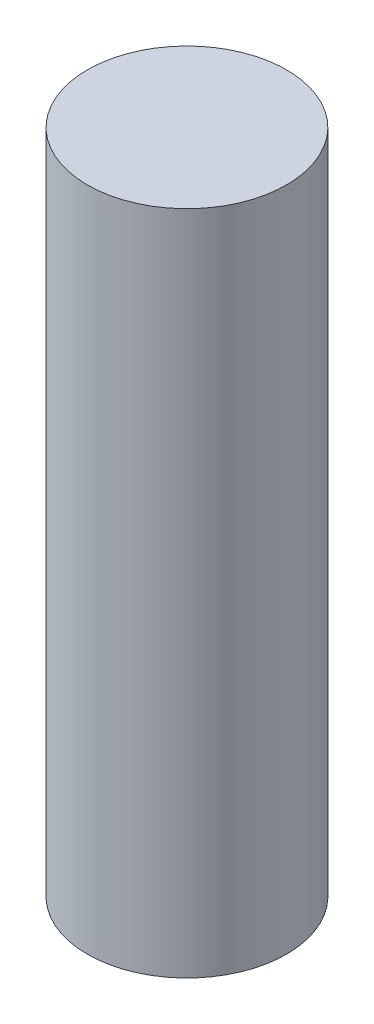
ISO-10303-21;
HEADER;
FILE_DESCRIPTION(('STEP AP214'),'2;1');
FILE_NAME('part.step','',(''),(''),'','','');
FILE_SCHEMA(('AUTOMOTIVE_DESIGN { 1 0 10303 214 1 1 1 1 }'));
ENDSEC;
DATA;
#1=APPLICATION_CONTEXT('core data for automotive mechanical design processes');
#2=APPLICATION_PROTOCOL_DEFINITION('international standard','automotive_design',2000,#1);
#3=PRODUCT_CONTEXT('',#1,'mechanical');
#4=PRODUCT('Part','Part','',(#3));
#5=PRODUCT_RELATED_PRODUCT_CATEGORY('part','',(#4));
#6=PRODUCT_DEFINITION_FORMATION('','',#4);
#7=PRODUCT_DEFINITION_CONTEXT('part definition',#1,'design');
#8=PRODUCT_DEFINITION('design','',#6,#7);
#9=PRODUCT_DEFINITION_SHAPE('','',#8);
#10=(LENGTH_UNIT() NAMED_UNIT(*) SI_UNIT(.MILLI.,.METRE.));
#11=(NAMED_UNIT(*) PLANE_ANGLE_UNIT() SI_UNIT($,.RADIAN.));
#12=(NAMED_UNIT(*) SI_UNIT($,.STERADIAN.) SOLID_ANGLE_UNIT());
#13=UNCERTAINTY_MEASURE_WITH_UNIT(LENGTH_MEASURE(1.E-05),#10,'distance_accuracy_value','');
#14=(GEOMETRIC_REPRESENTATION_CONTEXT(3) GLOBAL_UNCERTAINTY_ASSIGNED_CONTEXT((#13)) GLOBAL_UNIT_ASSIGNED_CONTEXT((#10,
#11,#12)) REPRESENTATION_CONTEXT('',''));
#15=CARTESIAN_POINT('',(0.,0.,0.));
#16=DIRECTION('',(0.,0.,1.));
#17=DIRECTION('',(1.,0.,0.));
#18=AXIS2_PLACEMENT_3D('',#15,#16,#17);
#19=CARTESIAN_POINT('',(0.,33.43,0.));
#20=DIRECTION('',(0.,-1.,0.));
#21=DIRECTION('',(0.,0.,-1.));
#22=AXIS2_PLACEMENT_3D('',#19,#20,#21);
#23=CYLINDRICAL_SURFACE('',#22,5.);
#24=CARTESIAN_POINT('',(0.,33.43,0.));
#25=DIRECTION('',(0.,1.,0.));
#26=DIRECTION('',(0.,0.,1.));
#27=AXIS2_PLACEMENT_3D('',#24,#25,#26);
#28=CIRCLE('',#27,5.);
#29=CARTESIAN_POINT('',(0.,33.43,5.));
#30=VERTEX_POINT('',#29);
#31=EDGE_CURVE('E10',#30,#30,#28,.T.);
#32=ORIENTED_EDGE('',*,*,#31,.F.);
#33=EDGE_LOOP('',(#32));
#34=FACE_BOUND('',#33,.T.);
#35=CARTESIAN_POINT('',(0.,0.,0.));
#36=DIRECTION('',(0.,1.,0.));
#37=DIRECTION('',(0.,0.,1.));
#38=AXIS2_PLACEMENT_3D('',#35,#36,#37);
#39=CIRCLE('',#38,5.);
#40=CARTESIAN_POINT('',(0.,0.,5.));
#41=VERTEX_POINT('',#40);
#42=EDGE_CURVE('E33',#41,#41,#39,.T.);
#43=ORIENTED_EDGE('',*,*,#42,.T.);
#44=EDGE_LOOP('',(#43));
#45=FACE_BOUND('',#44,.T.);
#46=ADVANCED_FACE('F30',(#34,#45),#23,.T.);
#47=CARTESIAN_POINT('',(0.,33.43,0.));
#48=DIRECTION('',(0.,1.,0.));
#49=DIRECTION('',(0.,0.,1.));
#50=AXIS2_PLACEMENT_3D('',#47,#48,#49);
#51=PLANE('',#50);
#52=ORIENTED_EDGE('',*,*,#31,.T.);
#53=EDGE_LOOP('',(#52));
#54=FACE_BOUND('',#53,.T.);
#55=ADVANCED_FACE('F45',(#54),#51,.T.);
#56=CARTESIAN_POINT('',(0.,0.,0.));
#57=DIRECTION('',(0.,1.,0.));
#58=DIRECTION('',(0.,0.,1.));
#59=AXIS2_PLACEMENT_3D('',#56,#57,#58);
#60=PLANE('',#59);
#61=ORIENTED_EDGE('',*,*,#42,.F.);
#62=EDGE_LOOP('',(#61));
#63=FACE_BOUND('',#62,.T.);
#64=ADVANCED_FACE('F43',(#63),#60,.F.);
#65=CLOSED_SHELL('',(#46,#55,#64));
#66=MANIFOLD_SOLID_BREP('B2',#65);
#67=ADVANCED_BREP_SHAPE_REPRESENTATION('',(#18,#66),#14);
#68=SHAPE_DEFINITION_REPRESENTATION(#9,#67);
ENDSEC;
END-ISO-10303-21;
